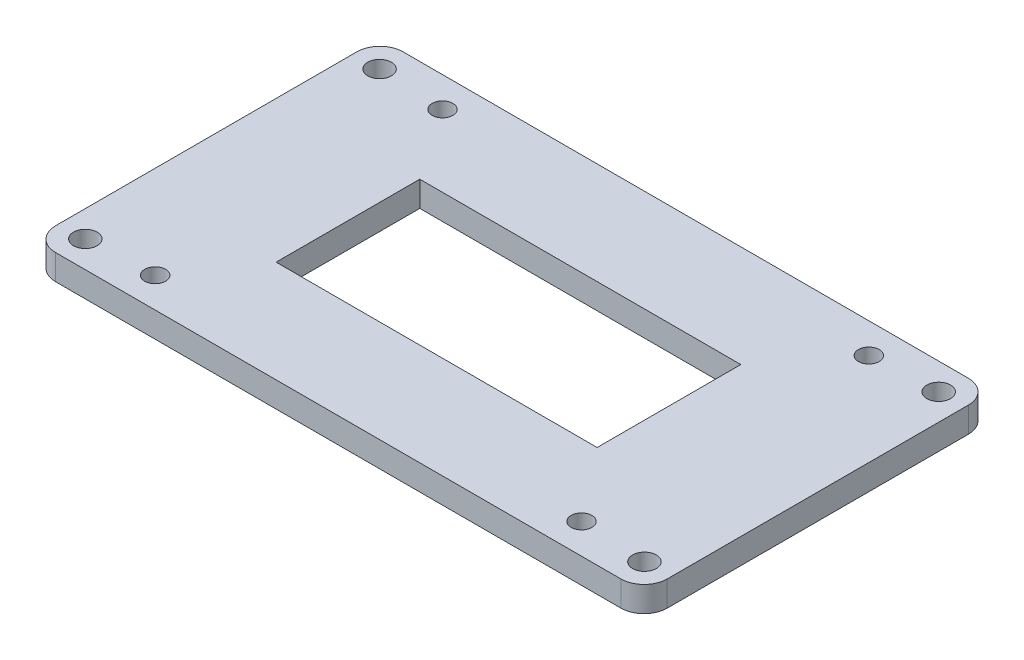
ISO-10303-21;
HEADER;
FILE_DESCRIPTION(('STEP AP214'),'2;1');
FILE_NAME('part.step','',(''),(''),'','','');
FILE_SCHEMA(('AUTOMOTIVE_DESIGN { 1 0 10303 214 1 1 1 1 }'));
ENDSEC;
DATA;
#1=APPLICATION_CONTEXT('core data for automotive mechanical design processes');
#2=APPLICATION_PROTOCOL_DEFINITION('international standard','automotive_design',2000,#1);
#3=PRODUCT_CONTEXT('',#1,'mechanical');
#4=PRODUCT('Part','Part','',(#3));
#5=PRODUCT_RELATED_PRODUCT_CATEGORY('part','',(#4));
#6=PRODUCT_DEFINITION_FORMATION('','',#4);
#7=PRODUCT_DEFINITION_CONTEXT('part definition',#1,'design');
#8=PRODUCT_DEFINITION('design','',#6,#7);
#9=PRODUCT_DEFINITION_SHAPE('','',#8);
#10=(LENGTH_UNIT() NAMED_UNIT(*) SI_UNIT(.MILLI.,.METRE.));
#11=(NAMED_UNIT(*) PLANE_ANGLE_UNIT() SI_UNIT($,.RADIAN.));
#12=(NAMED_UNIT(*) SI_UNIT($,.STERADIAN.) SOLID_ANGLE_UNIT());
#13=UNCERTAINTY_MEASURE_WITH_UNIT(LENGTH_MEASURE(1.E-05),#10,'distance_accuracy_value','');
#14=(GEOMETRIC_REPRESENTATION_CONTEXT(3) GLOBAL_UNCERTAINTY_ASSIGNED_CONTEXT((#13)) GLOBAL_UNIT_ASSIGNED_CONTEXT((#10,
#11,#12)) REPRESENTATION_CONTEXT('',''));
#15=CARTESIAN_POINT('',(0.,0.,0.));
#16=DIRECTION('',(0.,0.,1.));
#17=DIRECTION('',(1.,0.,0.));
#18=AXIS2_PLACEMENT_3D('',#15,#16,#17);
#19=CARTESIAN_POINT('',(66.,5.461,-37.5));
#20=DIRECTION('',(-1.,0.,0.));
#21=DIRECTION('',(0.,0.,1.));
#22=AXIS2_PLACEMENT_3D('',#19,#20,#21);
#23=PLANE('',#22);
#24=DIRECTION('',(0.,0.,-1.));
#25=VECTOR('',#24,1.);
#26=CARTESIAN_POINT('',(66.,5.461,-37.5));
#27=LINE('',#26,#25);
#28=CARTESIAN_POINT('',(66.,5.461,32.5));
#29=VERTEX_POINT('',#28);
#30=CARTESIAN_POINT('',(66.,5.461,-32.5));
#31=VERTEX_POINT('',#30);
#32=EDGE_CURVE('E206',#29,#31,#27,.T.);
#33=ORIENTED_EDGE('',*,*,#32,.F.);
#34=DIRECTION('',(0.,-1.,0.));
#35=VECTOR('',#34,1.);
#36=CARTESIAN_POINT('',(66.,5.461,32.5));
#37=LINE('',#36,#35);
#38=CARTESIAN_POINT('',(66.,0.,32.5));
#39=VERTEX_POINT('',#38);
#40=EDGE_CURVE('E231',#29,#39,#37,.T.);
#41=ORIENTED_EDGE('',*,*,#40,.T.);
#42=DIRECTION('',(0.,0.,-1.));
#43=VECTOR('',#42,1.);
#44=CARTESIAN_POINT('',(66.,0.,-37.5));
#45=LINE('',#44,#43);
#46=CARTESIAN_POINT('',(66.,0.,-32.5));
#47=VERTEX_POINT('',#46);
#48=EDGE_CURVE('E205',#39,#47,#45,.T.);
#49=ORIENTED_EDGE('',*,*,#48,.T.);
#50=DIRECTION('',(0.,-1.,0.));
#51=VECTOR('',#50,1.);
#52=CARTESIAN_POINT('',(66.,5.461,-32.5));
#53=LINE('',#52,#51);
#54=EDGE_CURVE('E219',#47,#31,#53,.F.);
#55=ORIENTED_EDGE('',*,*,#54,.T.);
#56=EDGE_LOOP('',(#33,#41,#49,#55));
#57=FACE_BOUND('',#56,.T.);
#58=ADVANCED_FACE('F33',(#57),#23,.F.);
#59=CARTESIAN_POINT('',(-66.,5.461,-37.5));
#60=DIRECTION('',(0.,0.,1.));
#61=DIRECTION('',(1.,0.,0.));
#62=AXIS2_PLACEMENT_3D('',#59,#60,#61);
#63=PLANE('',#62);
#64=DIRECTION('',(-1.,0.,0.));
#65=VECTOR('',#64,1.);
#66=CARTESIAN_POINT('',(-66.,5.461,-37.5));
#67=LINE('',#66,#65);
#68=CARTESIAN_POINT('',(61.,5.461,-37.5));
#69=VERTEX_POINT('',#68);
#70=CARTESIAN_POINT('',(-61.,5.461,-37.5));
#71=VERTEX_POINT('',#70);
#72=EDGE_CURVE('E209',#69,#71,#67,.T.);
#73=ORIENTED_EDGE('',*,*,#72,.F.);
#74=DIRECTION('',(0.,-1.,0.));
#75=VECTOR('',#74,1.);
#76=CARTESIAN_POINT('',(61.,5.461,-37.5));
#77=LINE('',#76,#75);
#78=CARTESIAN_POINT('',(61.,0.,-37.5));
#79=VERTEX_POINT('',#78);
#80=EDGE_CURVE('E257',#69,#79,#77,.T.);
#81=ORIENTED_EDGE('',*,*,#80,.T.);
#82=DIRECTION('',(-1.,0.,0.));
#83=VECTOR('',#82,1.);
#84=CARTESIAN_POINT('',(-66.,0.,-37.5));
#85=LINE('',#84,#83);
#86=CARTESIAN_POINT('',(-61.,0.,-37.5));
#87=VERTEX_POINT('',#86);
#88=EDGE_CURVE('E222',#79,#87,#85,.T.);
#89=ORIENTED_EDGE('',*,*,#88,.T.);
#90=DIRECTION('',(0.,-1.,0.));
#91=VECTOR('',#90,1.);
#92=CARTESIAN_POINT('',(-61.,5.461,-37.5));
#93=LINE('',#92,#91);
#94=EDGE_CURVE('E255',#87,#71,#93,.F.);
#95=ORIENTED_EDGE('',*,*,#94,.T.);
#96=EDGE_LOOP('',(#73,#81,#89,#95));
#97=FACE_BOUND('',#96,.T.);
#98=ADVANCED_FACE('F295',(#97),#63,.F.);
#99=CARTESIAN_POINT('',(-66.,5.461,-37.5));
#100=DIRECTION('',(1.,0.,0.));
#101=DIRECTION('',(0.,0.,-1.));
#102=AXIS2_PLACEMENT_3D('',#99,#100,#101);
#103=PLANE('',#102);
#104=DIRECTION('',(0.,0.,1.));
#105=VECTOR('',#104,1.);
#106=CARTESIAN_POINT('',(-66.,0.,-37.5));
#107=LINE('',#106,#105);
#108=CARTESIAN_POINT('',(-66.,0.,-32.5));
#109=VERTEX_POINT('',#108);
#110=CARTESIAN_POINT('',(-66.,0.,32.5));
#111=VERTEX_POINT('',#110);
#112=EDGE_CURVE('E225',#109,#111,#107,.T.);
#113=ORIENTED_EDGE('',*,*,#112,.T.);
#114=DIRECTION('',(0.,-1.,0.));
#115=VECTOR('',#114,1.);
#116=CARTESIAN_POINT('',(-66.,5.461,32.5));
#117=LINE('',#116,#115);
#118=CARTESIAN_POINT('',(-66.,5.461,32.5));
#119=VERTEX_POINT('',#118);
#120=EDGE_CURVE('E11',#111,#119,#117,.F.);
#121=ORIENTED_EDGE('',*,*,#120,.T.);
#122=DIRECTION('',(0.,0.,1.));
#123=VECTOR('',#122,1.);
#124=CARTESIAN_POINT('',(-66.,5.461,-37.5));
#125=LINE('',#124,#123);
#126=CARTESIAN_POINT('',(-66.,5.461,-32.5));
#127=VERTEX_POINT('',#126);
#128=EDGE_CURVE('E213',#127,#119,#125,.T.);
#129=ORIENTED_EDGE('',*,*,#128,.F.);
#130=DIRECTION('',(0.,-1.,0.));
#131=VECTOR('',#130,1.);
#132=CARTESIAN_POINT('',(-66.,5.461,-32.5));
#133=LINE('',#132,#131);
#134=EDGE_CURVE('E41',#127,#109,#133,.T.);
#135=ORIENTED_EDGE('',*,*,#134,.T.);
#136=EDGE_LOOP('',(#113,#121,#129,#135));
#137=FACE_BOUND('',#136,.T.);
#138=ADVANCED_FACE('F264',(#137),#103,.F.);
#139=CARTESIAN_POINT('',(-66.,5.461,37.5));
#140=DIRECTION('',(0.,0.,-1.));
#141=DIRECTION('',(-1.,0.,0.));
#142=AXIS2_PLACEMENT_3D('',#139,#140,#141);
#143=PLANE('',#142);
#144=DIRECTION('',(1.,0.,0.));
#145=VECTOR('',#144,1.);
#146=CARTESIAN_POINT('',(-66.,0.,37.5));
#147=LINE('',#146,#145);
#148=CARTESIAN_POINT('',(-61.,0.,37.5));
#149=VERTEX_POINT('',#148);
#150=CARTESIAN_POINT('',(61.,0.,37.5));
#151=VERTEX_POINT('',#150);
#152=EDGE_CURVE('E210',#149,#151,#147,.T.);
#153=ORIENTED_EDGE('',*,*,#152,.T.);
#154=DIRECTION('',(0.,-1.,0.));
#155=VECTOR('',#154,1.);
#156=CARTESIAN_POINT('',(61.,5.461,37.5));
#157=LINE('',#156,#155);
#158=CARTESIAN_POINT('',(61.,5.461,37.5));
#159=VERTEX_POINT('',#158);
#160=EDGE_CURVE('E245',#151,#159,#157,.F.);
#161=ORIENTED_EDGE('',*,*,#160,.T.);
#162=DIRECTION('',(1.,0.,0.));
#163=VECTOR('',#162,1.);
#164=CARTESIAN_POINT('',(-66.,5.461,37.5));
#165=LINE('',#164,#163);
#166=CARTESIAN_POINT('',(-61.,5.461,37.5));
#167=VERTEX_POINT('',#166);
#168=EDGE_CURVE('E216',#167,#159,#165,.T.);
#169=ORIENTED_EDGE('',*,*,#168,.F.);
#170=DIRECTION('',(0.,-1.,0.));
#171=VECTOR('',#170,1.);
#172=CARTESIAN_POINT('',(-61.,5.461,37.5));
#173=LINE('',#172,#171);
#174=EDGE_CURVE('E242',#167,#149,#173,.T.);
#175=ORIENTED_EDGE('',*,*,#174,.T.);
#176=EDGE_LOOP('',(#153,#161,#169,#175));
#177=FACE_BOUND('',#176,.T.);
#178=ADVANCED_FACE('F278',(#177),#143,.F.);
#179=CARTESIAN_POINT('',(0.,5.461,0.));
#180=DIRECTION('',(0.,1.,0.));
#181=DIRECTION('',(0.,0.,1.));
#182=AXIS2_PLACEMENT_3D('',#179,#180,#181);
#183=PLANE('',#182);
#184=DIRECTION('',(0.,0.,-1.));
#185=VECTOR('',#184,1.);
#186=CARTESIAN_POINT('',(33.87,5.461,-15.5));
#187=LINE('',#186,#185);
#188=CARTESIAN_POINT('',(33.87,5.461,15.5));
#189=VERTEX_POINT('',#188);
#190=CARTESIAN_POINT('',(33.87,5.461,-15.5));
#191=VERTEX_POINT('',#190);
#192=EDGE_CURVE('E48',#189,#191,#187,.T.);
#193=ORIENTED_EDGE('',*,*,#192,.F.);
#194=DIRECTION('',(1.,0.,0.));
#195=VECTOR('',#194,1.);
#196=CARTESIAN_POINT('',(-35.4,5.461,15.5));
#197=LINE('',#196,#195);
#198=CARTESIAN_POINT('',(-35.4,5.461,15.5));
#199=VERTEX_POINT('',#198);
#200=EDGE_CURVE('E139',#199,#189,#197,.T.);
#201=ORIENTED_EDGE('',*,*,#200,.F.);
#202=DIRECTION('',(0.,0.,1.));
#203=VECTOR('',#202,1.);
#204=CARTESIAN_POINT('',(-35.4,5.461,-15.5));
#205=LINE('',#204,#203);
#206=CARTESIAN_POINT('',(-35.4,5.461,-15.5));
#207=VERTEX_POINT('',#206);
#208=EDGE_CURVE('E142',#207,#199,#205,.T.);
#209=ORIENTED_EDGE('',*,*,#208,.F.);
#210=DIRECTION('',(-1.,0.,0.));
#211=VECTOR('',#210,1.);
#212=CARTESIAN_POINT('',(-35.4,5.461,-15.5));
#213=LINE('',#212,#211);
#214=EDGE_CURVE('E148',#191,#207,#213,.T.);
#215=ORIENTED_EDGE('',*,*,#214,.F.);
#216=EDGE_LOOP('',(#193,#201,#209,#215));
#217=FACE_BOUND('',#216,.T.);
#218=CARTESIAN_POINT('',(60.325,5.461,31.75));
#219=DIRECTION('',(0.,1.,0.));
#220=DIRECTION('',(0.,0.,1.));
#221=AXIS2_PLACEMENT_3D('',#218,#219,#220);
#222=CIRCLE('',#221,2.5527);
#223=CARTESIAN_POINT('',(60.325,5.461,34.3027));
#224=VERTEX_POINT('',#223);
#225=EDGE_CURVE('E154',#224,#224,#222,.T.);
#226=ORIENTED_EDGE('',*,*,#225,.F.);
#227=EDGE_LOOP('',(#226));
#228=FACE_BOUND('',#227,.T.);
#229=CARTESIAN_POINT('',(-60.325,5.461,-31.75));
#230=DIRECTION('',(0.,1.,0.));
#231=DIRECTION('',(0.,0.,1.));
#232=AXIS2_PLACEMENT_3D('',#229,#230,#231);
#233=CIRCLE('',#232,2.5527);
#234=CARTESIAN_POINT('',(-60.325,5.461,-29.1973));
#235=VERTEX_POINT('',#234);
#236=EDGE_CURVE('E163',#235,#235,#233,.T.);
#237=ORIENTED_EDGE('',*,*,#236,.F.);
#238=EDGE_LOOP('',(#237));
#239=FACE_BOUND('',#238,.T.);
#240=CARTESIAN_POINT('',(-60.325,5.461,31.75));
#241=DIRECTION('',(0.,1.,0.));
#242=DIRECTION('',(0.,0.,1.));
#243=AXIS2_PLACEMENT_3D('',#240,#241,#242);
#244=CIRCLE('',#243,2.5527);
#245=CARTESIAN_POINT('',(-60.325,5.461,34.3027));
#246=VERTEX_POINT('',#245);
#247=EDGE_CURVE('E169',#246,#246,#244,.T.);
#248=ORIENTED_EDGE('',*,*,#247,.F.);
#249=EDGE_LOOP('',(#248));
#250=FACE_BOUND('',#249,.T.);
#251=CARTESIAN_POINT('',(60.325,5.461,-31.75));
#252=DIRECTION('',(0.,1.,0.));
#253=DIRECTION('',(0.,0.,1.));
#254=AXIS2_PLACEMENT_3D('',#251,#252,#253);
#255=CIRCLE('',#254,2.5527);
#256=CARTESIAN_POINT('',(60.325,5.461,-29.1973));
#257=VERTEX_POINT('',#256);
#258=EDGE_CURVE('E175',#257,#257,#255,.T.);
#259=ORIENTED_EDGE('',*,*,#258,.F.);
#260=EDGE_LOOP('',(#259));
#261=FACE_BOUND('',#260,.T.);
#262=CARTESIAN_POINT('',(46.,5.461,31.));
#263=DIRECTION('',(0.,1.,0.));
#264=DIRECTION('',(0.,0.,1.));
#265=AXIS2_PLACEMENT_3D('',#262,#263,#264);
#266=CIRCLE('',#265,2.2479);
#267=CARTESIAN_POINT('',(46.,5.461,33.2479));
#268=VERTEX_POINT('',#267);
#269=EDGE_CURVE('E181',#268,#268,#266,.T.);
#270=ORIENTED_EDGE('',*,*,#269,.F.);
#271=EDGE_LOOP('',(#270));
#272=FACE_BOUND('',#271,.T.);
#273=CARTESIAN_POINT('',(-46.,5.461,-31.));
#274=DIRECTION('',(0.,1.,0.));
#275=DIRECTION('',(0.,0.,1.));
#276=AXIS2_PLACEMENT_3D('',#273,#274,#275);
#277=CIRCLE('',#276,2.2479);
#278=CARTESIAN_POINT('',(-46.,5.461,-28.7521));
#279=VERTEX_POINT('',#278);
#280=EDGE_CURVE('E187',#279,#279,#277,.T.);
#281=ORIENTED_EDGE('',*,*,#280,.F.);
#282=EDGE_LOOP('',(#281));
#283=FACE_BOUND('',#282,.T.);
#284=CARTESIAN_POINT('',(-46.,5.461,31.));
#285=DIRECTION('',(0.,1.,0.));
#286=DIRECTION('',(0.,0.,1.));
#287=AXIS2_PLACEMENT_3D('',#284,#285,#286);
#288=CIRCLE('',#287,2.2479);
#289=CARTESIAN_POINT('',(-46.,5.461,33.2479));
#290=VERTEX_POINT('',#289);
#291=EDGE_CURVE('E193',#290,#290,#288,.T.);
#292=ORIENTED_EDGE('',*,*,#291,.F.);
#293=EDGE_LOOP('',(#292));
#294=FACE_BOUND('',#293,.T.);
#295=CARTESIAN_POINT('',(46.,5.461,-31.));
#296=DIRECTION('',(0.,1.,0.));
#297=DIRECTION('',(0.,0.,1.));
#298=AXIS2_PLACEMENT_3D('',#295,#296,#297);
#299=CIRCLE('',#298,2.2479);
#300=CARTESIAN_POINT('',(46.,5.461,-28.7521));
#301=VERTEX_POINT('',#300);
#302=EDGE_CURVE('E199',#301,#301,#299,.T.);
#303=ORIENTED_EDGE('',*,*,#302,.F.);
#304=EDGE_LOOP('',(#303));
#305=FACE_BOUND('',#304,.T.);
#306=ORIENTED_EDGE('',*,*,#168,.T.);
#307=CARTESIAN_POINT('',(61.,5.461,32.5));
#308=DIRECTION('',(0.,1.,0.));
#309=DIRECTION('',(0.,0.,1.));
#310=AXIS2_PLACEMENT_3D('',#307,#308,#309);
#311=CIRCLE('',#310,5.);
#312=EDGE_CURVE('E253',#159,#29,#311,.T.);
#313=ORIENTED_EDGE('',*,*,#312,.T.);
#314=ORIENTED_EDGE('',*,*,#32,.T.);
#315=CARTESIAN_POINT('',(61.,5.461,-32.5));
#316=DIRECTION('',(0.,1.,0.));
#317=DIRECTION('',(0.,0.,1.));
#318=AXIS2_PLACEMENT_3D('',#315,#316,#317);
#319=CIRCLE('',#318,5.);
#320=EDGE_CURVE('E251',#31,#69,#319,.T.);
#321=ORIENTED_EDGE('',*,*,#320,.T.);
#322=ORIENTED_EDGE('',*,*,#72,.T.);
#323=CARTESIAN_POINT('',(-61.,5.461,-32.5));
#324=DIRECTION('',(0.,1.,0.));
#325=DIRECTION('',(0.,0.,1.));
#326=AXIS2_PLACEMENT_3D('',#323,#324,#325);
#327=CIRCLE('',#326,5.);
#328=EDGE_CURVE('E247',#71,#127,#327,.T.);
#329=ORIENTED_EDGE('',*,*,#328,.T.);
#330=ORIENTED_EDGE('',*,*,#128,.T.);
#331=CARTESIAN_POINT('',(-61.,5.461,32.5));
#332=DIRECTION('',(0.,1.,0.));
#333=DIRECTION('',(0.,0.,1.));
#334=AXIS2_PLACEMENT_3D('',#331,#332,#333);
#335=CIRCLE('',#334,5.);
#336=EDGE_CURVE('E249',#119,#167,#335,.T.);
#337=ORIENTED_EDGE('',*,*,#336,.T.);
#338=EDGE_LOOP('',(#306,#313,#314,#321,#322,#329,#330,#337));
#339=FACE_BOUND('',#338,.T.);
#340=ADVANCED_FACE('F282',(#217,#228,#239,#250,#261,#272,#283,#294,#305,#339),#183,.T.);
#341=CARTESIAN_POINT('',(0.,0.,0.));
#342=DIRECTION('',(0.,1.,0.));
#343=DIRECTION('',(0.,0.,1.));
#344=AXIS2_PLACEMENT_3D('',#341,#342,#343);
#345=PLANE('',#344);
#346=DIRECTION('',(1.,0.,0.));
#347=VECTOR('',#346,1.);
#348=CARTESIAN_POINT('',(-35.4,0.,15.5));
#349=LINE('',#348,#347);
#350=CARTESIAN_POINT('',(-35.4,0.,15.5));
#351=VERTEX_POINT('',#350);
#352=CARTESIAN_POINT('',(33.87,0.,15.5));
#353=VERTEX_POINT('',#352);
#354=EDGE_CURVE('E129',#351,#353,#349,.T.);
#355=ORIENTED_EDGE('',*,*,#354,.T.);
#356=DIRECTION('',(0.,0.,-1.));
#357=VECTOR('',#356,1.);
#358=CARTESIAN_POINT('',(33.87,0.,-15.5));
#359=LINE('',#358,#357);
#360=CARTESIAN_POINT('',(33.87,0.,-15.5));
#361=VERTEX_POINT('',#360);
#362=EDGE_CURVE('E123',#353,#361,#359,.T.);
#363=ORIENTED_EDGE('',*,*,#362,.T.);
#364=DIRECTION('',(-1.,0.,0.));
#365=VECTOR('',#364,1.);
#366=CARTESIAN_POINT('',(-35.4,0.,-15.5));
#367=LINE('',#366,#365);
#368=CARTESIAN_POINT('',(-35.4,0.,-15.5));
#369=VERTEX_POINT('',#368);
#370=EDGE_CURVE('E132',#361,#369,#367,.T.);
#371=ORIENTED_EDGE('',*,*,#370,.T.);
#372=DIRECTION('',(0.,0.,1.));
#373=VECTOR('',#372,1.);
#374=CARTESIAN_POINT('',(-35.4,0.,-15.5));
#375=LINE('',#374,#373);
#376=EDGE_CURVE('E56',#369,#351,#375,.T.);
#377=ORIENTED_EDGE('',*,*,#376,.T.);
#378=EDGE_LOOP('',(#355,#363,#371,#377));
#379=FACE_BOUND('',#378,.T.);
#380=CARTESIAN_POINT('',(60.325,0.,31.75));
#381=DIRECTION('',(0.,1.,0.));
#382=DIRECTION('',(0.,0.,1.));
#383=AXIS2_PLACEMENT_3D('',#380,#381,#382);
#384=CIRCLE('',#383,2.5527);
#385=CARTESIAN_POINT('',(60.325,0.,34.3027));
#386=VERTEX_POINT('',#385);
#387=EDGE_CURVE('E160',#386,#386,#384,.T.);
#388=ORIENTED_EDGE('',*,*,#387,.T.);
#389=EDGE_LOOP('',(#388));
#390=FACE_BOUND('',#389,.T.);
#391=CARTESIAN_POINT('',(-60.325,0.,-31.75));
#392=DIRECTION('',(0.,1.,0.));
#393=DIRECTION('',(0.,0.,1.));
#394=AXIS2_PLACEMENT_3D('',#391,#392,#393);
#395=CIRCLE('',#394,2.5527);
#396=CARTESIAN_POINT('',(-60.325,0.,-29.1973));
#397=VERTEX_POINT('',#396);
#398=EDGE_CURVE('E166',#397,#397,#395,.T.);
#399=ORIENTED_EDGE('',*,*,#398,.T.);
#400=EDGE_LOOP('',(#399));
#401=FACE_BOUND('',#400,.T.);
#402=CARTESIAN_POINT('',(-60.325,0.,31.75));
#403=DIRECTION('',(0.,1.,0.));
#404=DIRECTION('',(0.,0.,1.));
#405=AXIS2_PLACEMENT_3D('',#402,#403,#404);
#406=CIRCLE('',#405,2.5527);
#407=CARTESIAN_POINT('',(-60.325,0.,34.3027));
#408=VERTEX_POINT('',#407);
#409=EDGE_CURVE('E172',#408,#408,#406,.T.);
#410=ORIENTED_EDGE('',*,*,#409,.T.);
#411=EDGE_LOOP('',(#410));
#412=FACE_BOUND('',#411,.T.);
#413=CARTESIAN_POINT('',(60.325,0.,-31.75));
#414=DIRECTION('',(0.,1.,0.));
#415=DIRECTION('',(0.,0.,1.));
#416=AXIS2_PLACEMENT_3D('',#413,#414,#415);
#417=CIRCLE('',#416,2.5527);
#418=CARTESIAN_POINT('',(60.325,0.,-29.1973));
#419=VERTEX_POINT('',#418);
#420=EDGE_CURVE('E178',#419,#419,#417,.T.);
#421=ORIENTED_EDGE('',*,*,#420,.T.);
#422=EDGE_LOOP('',(#421));
#423=FACE_BOUND('',#422,.T.);
#424=CARTESIAN_POINT('',(46.,0.,31.));
#425=DIRECTION('',(0.,1.,0.));
#426=DIRECTION('',(0.,0.,1.));
#427=AXIS2_PLACEMENT_3D('',#424,#425,#426);
#428=CIRCLE('',#427,2.2479);
#429=CARTESIAN_POINT('',(46.,0.,33.2479));
#430=VERTEX_POINT('',#429);
#431=EDGE_CURVE('E184',#430,#430,#428,.T.);
#432=ORIENTED_EDGE('',*,*,#431,.T.);
#433=EDGE_LOOP('',(#432));
#434=FACE_BOUND('',#433,.T.);
#435=CARTESIAN_POINT('',(-46.,0.,-31.));
#436=DIRECTION('',(0.,1.,0.));
#437=DIRECTION('',(0.,0.,1.));
#438=AXIS2_PLACEMENT_3D('',#435,#436,#437);
#439=CIRCLE('',#438,2.2479);
#440=CARTESIAN_POINT('',(-46.,0.,-28.7521));
#441=VERTEX_POINT('',#440);
#442=EDGE_CURVE('E190',#441,#441,#439,.T.);
#443=ORIENTED_EDGE('',*,*,#442,.T.);
#444=EDGE_LOOP('',(#443));
#445=FACE_BOUND('',#444,.T.);
#446=CARTESIAN_POINT('',(-46.,0.,31.));
#447=DIRECTION('',(0.,1.,0.));
#448=DIRECTION('',(0.,0.,1.));
#449=AXIS2_PLACEMENT_3D('',#446,#447,#448);
#450=CIRCLE('',#449,2.2479);
#451=CARTESIAN_POINT('',(-46.,0.,33.2479));
#452=VERTEX_POINT('',#451);
#453=EDGE_CURVE('E196',#452,#452,#450,.T.);
#454=ORIENTED_EDGE('',*,*,#453,.T.);
#455=EDGE_LOOP('',(#454));
#456=FACE_BOUND('',#455,.T.);
#457=CARTESIAN_POINT('',(46.,0.,-31.));
#458=DIRECTION('',(0.,1.,0.));
#459=DIRECTION('',(0.,0.,1.));
#460=AXIS2_PLACEMENT_3D('',#457,#458,#459);
#461=CIRCLE('',#460,2.2479);
#462=CARTESIAN_POINT('',(46.,0.,-28.7521));
#463=VERTEX_POINT('',#462);
#464=EDGE_CURVE('E202',#463,#463,#461,.T.);
#465=ORIENTED_EDGE('',*,*,#464,.T.);
#466=EDGE_LOOP('',(#465));
#467=FACE_BOUND('',#466,.T.);
#468=ORIENTED_EDGE('',*,*,#48,.F.);
#469=CARTESIAN_POINT('',(61.,0.,32.5));
#470=DIRECTION('',(0.,1.,0.));
#471=DIRECTION('',(0.,0.,1.));
#472=AXIS2_PLACEMENT_3D('',#469,#470,#471);
#473=CIRCLE('',#472,5.);
#474=EDGE_CURVE('E240',#39,#151,#473,.F.);
#475=ORIENTED_EDGE('',*,*,#474,.T.);
#476=ORIENTED_EDGE('',*,*,#152,.F.);
#477=CARTESIAN_POINT('',(-61.,0.,32.5));
#478=DIRECTION('',(0.,1.,0.));
#479=DIRECTION('',(0.,0.,1.));
#480=AXIS2_PLACEMENT_3D('',#477,#478,#479);
#481=CIRCLE('',#480,5.);
#482=EDGE_CURVE('E236',#149,#111,#481,.F.);
#483=ORIENTED_EDGE('',*,*,#482,.T.);
#484=ORIENTED_EDGE('',*,*,#112,.F.);
#485=CARTESIAN_POINT('',(-61.,0.,-32.5));
#486=DIRECTION('',(0.,1.,0.));
#487=DIRECTION('',(0.,0.,1.));
#488=AXIS2_PLACEMENT_3D('',#485,#486,#487);
#489=CIRCLE('',#488,5.);
#490=EDGE_CURVE('E234',#109,#87,#489,.F.);
#491=ORIENTED_EDGE('',*,*,#490,.T.);
#492=ORIENTED_EDGE('',*,*,#88,.F.);
#493=CARTESIAN_POINT('',(61.,0.,-32.5));
#494=DIRECTION('',(0.,1.,0.));
#495=DIRECTION('',(0.,0.,1.));
#496=AXIS2_PLACEMENT_3D('',#493,#494,#495);
#497=CIRCLE('',#496,5.);
#498=EDGE_CURVE('E238',#79,#47,#497,.F.);
#499=ORIENTED_EDGE('',*,*,#498,.T.);
#500=EDGE_LOOP('',(#468,#475,#476,#483,#484,#491,#492,#499));
#501=FACE_BOUND('',#500,.T.);
#502=ADVANCED_FACE('F136',(#379,#390,#401,#412,#423,#434,#445,#456,#467,#501),#345,.F.);
#503=CARTESIAN_POINT('',(46.,5.461,-31.));
#504=DIRECTION('',(0.,1.,0.));
#505=DIRECTION('',(0.,0.,1.));
#506=AXIS2_PLACEMENT_3D('',#503,#504,#505);
#507=CYLINDRICAL_SURFACE('',#506,2.2479);
#508=ORIENTED_EDGE('',*,*,#464,.F.);
#509=EDGE_LOOP('',(#508));
#510=FACE_BOUND('',#509,.T.);
#511=ORIENTED_EDGE('',*,*,#302,.T.);
#512=EDGE_LOOP('',(#511));
#513=FACE_BOUND('',#512,.T.);
#514=ADVANCED_FACE('F346',(#510,#513),#507,.F.);
#515=CARTESIAN_POINT('',(-46.,5.461,31.));
#516=DIRECTION('',(0.,1.,0.));
#517=DIRECTION('',(0.,0.,1.));
#518=AXIS2_PLACEMENT_3D('',#515,#516,#517);
#519=CYLINDRICAL_SURFACE('',#518,2.2479);
#520=ORIENTED_EDGE('',*,*,#453,.F.);
#521=EDGE_LOOP('',(#520));
#522=FACE_BOUND('',#521,.T.);
#523=ORIENTED_EDGE('',*,*,#291,.T.);
#524=EDGE_LOOP('',(#523));
#525=FACE_BOUND('',#524,.T.);
#526=ADVANCED_FACE('F403',(#522,#525),#519,.F.);
#527=CARTESIAN_POINT('',(-46.,5.461,-31.));
#528=DIRECTION('',(0.,1.,0.));
#529=DIRECTION('',(0.,0.,1.));
#530=AXIS2_PLACEMENT_3D('',#527,#528,#529);
#531=CYLINDRICAL_SURFACE('',#530,2.2479);
#532=ORIENTED_EDGE('',*,*,#442,.F.);
#533=EDGE_LOOP('',(#532));
#534=FACE_BOUND('',#533,.T.);
#535=ORIENTED_EDGE('',*,*,#280,.T.);
#536=EDGE_LOOP('',(#535));
#537=FACE_BOUND('',#536,.T.);
#538=ADVANCED_FACE('F399',(#534,#537),#531,.F.);
#539=CARTESIAN_POINT('',(46.,5.461,31.));
#540=DIRECTION('',(0.,1.,0.));
#541=DIRECTION('',(0.,0.,1.));
#542=AXIS2_PLACEMENT_3D('',#539,#540,#541);
#543=CYLINDRICAL_SURFACE('',#542,2.2479);
#544=ORIENTED_EDGE('',*,*,#431,.F.);
#545=EDGE_LOOP('',(#544));
#546=FACE_BOUND('',#545,.T.);
#547=ORIENTED_EDGE('',*,*,#269,.T.);
#548=EDGE_LOOP('',(#547));
#549=FACE_BOUND('',#548,.T.);
#550=ADVANCED_FACE('F395',(#546,#549),#543,.F.);
#551=CARTESIAN_POINT('',(60.325,5.461,-31.75));
#552=DIRECTION('',(0.,1.,0.));
#553=DIRECTION('',(0.,0.,1.));
#554=AXIS2_PLACEMENT_3D('',#551,#552,#553);
#555=CYLINDRICAL_SURFACE('',#554,2.5527);
#556=ORIENTED_EDGE('',*,*,#420,.F.);
#557=EDGE_LOOP('',(#556));
#558=FACE_BOUND('',#557,.T.);
#559=ORIENTED_EDGE('',*,*,#258,.T.);
#560=EDGE_LOOP('',(#559));
#561=FACE_BOUND('',#560,.T.);
#562=ADVANCED_FACE('F391',(#558,#561),#555,.F.);
#563=CARTESIAN_POINT('',(-60.325,5.461,31.75));
#564=DIRECTION('',(0.,1.,0.));
#565=DIRECTION('',(0.,0.,1.));
#566=AXIS2_PLACEMENT_3D('',#563,#564,#565);
#567=CYLINDRICAL_SURFACE('',#566,2.5527);
#568=ORIENTED_EDGE('',*,*,#409,.F.);
#569=EDGE_LOOP('',(#568));
#570=FACE_BOUND('',#569,.T.);
#571=ORIENTED_EDGE('',*,*,#247,.T.);
#572=EDGE_LOOP('',(#571));
#573=FACE_BOUND('',#572,.T.);
#574=ADVANCED_FACE('F387',(#570,#573),#567,.F.);
#575=CARTESIAN_POINT('',(-60.325,5.461,-31.75));
#576=DIRECTION('',(0.,1.,0.));
#577=DIRECTION('',(0.,0.,1.));
#578=AXIS2_PLACEMENT_3D('',#575,#576,#577);
#579=CYLINDRICAL_SURFACE('',#578,2.5527);
#580=ORIENTED_EDGE('',*,*,#398,.F.);
#581=EDGE_LOOP('',(#580));
#582=FACE_BOUND('',#581,.T.);
#583=ORIENTED_EDGE('',*,*,#236,.T.);
#584=EDGE_LOOP('',(#583));
#585=FACE_BOUND('',#584,.T.);
#586=ADVANCED_FACE('F383',(#582,#585),#579,.F.);
#587=CARTESIAN_POINT('',(60.325,5.461,31.75));
#588=DIRECTION('',(0.,1.,0.));
#589=DIRECTION('',(0.,0.,1.));
#590=AXIS2_PLACEMENT_3D('',#587,#588,#589);
#591=CYLINDRICAL_SURFACE('',#590,2.5527);
#592=ORIENTED_EDGE('',*,*,#387,.F.);
#593=EDGE_LOOP('',(#592));
#594=FACE_BOUND('',#593,.T.);
#595=ORIENTED_EDGE('',*,*,#225,.T.);
#596=EDGE_LOOP('',(#595));
#597=FACE_BOUND('',#596,.T.);
#598=ADVANCED_FACE('F314',(#594,#597),#591,.F.);
#599=CARTESIAN_POINT('',(61.,5.461,32.5));
#600=DIRECTION('',(0.,-1.,0.));
#601=DIRECTION('',(0.,0.,-1.));
#602=AXIS2_PLACEMENT_3D('',#599,#600,#601);
#603=CYLINDRICAL_SURFACE('',#602,5.);
#604=ORIENTED_EDGE('',*,*,#312,.F.);
#605=ORIENTED_EDGE('',*,*,#160,.F.);
#606=ORIENTED_EDGE('',*,*,#474,.F.);
#607=ORIENTED_EDGE('',*,*,#40,.F.);
#608=EDGE_LOOP('',(#604,#605,#606,#607));
#609=FACE_BOUND('',#608,.T.);
#610=ADVANCED_FACE('F286',(#609),#603,.T.);
#611=CARTESIAN_POINT('',(61.,5.461,-32.5));
#612=DIRECTION('',(0.,-1.,0.));
#613=DIRECTION('',(0.,0.,-1.));
#614=AXIS2_PLACEMENT_3D('',#611,#612,#613);
#615=CYLINDRICAL_SURFACE('',#614,5.);
#616=ORIENTED_EDGE('',*,*,#320,.F.);
#617=ORIENTED_EDGE('',*,*,#54,.F.);
#618=ORIENTED_EDGE('',*,*,#498,.F.);
#619=ORIENTED_EDGE('',*,*,#80,.F.);
#620=EDGE_LOOP('',(#616,#617,#618,#619));
#621=FACE_BOUND('',#620,.T.);
#622=ADVANCED_FACE('F292',(#621),#615,.T.);
#623=CARTESIAN_POINT('',(-61.,5.461,32.5));
#624=DIRECTION('',(0.,-1.,0.));
#625=DIRECTION('',(0.,0.,-1.));
#626=AXIS2_PLACEMENT_3D('',#623,#624,#625);
#627=CYLINDRICAL_SURFACE('',#626,5.);
#628=ORIENTED_EDGE('',*,*,#336,.F.);
#629=ORIENTED_EDGE('',*,*,#120,.F.);
#630=ORIENTED_EDGE('',*,*,#482,.F.);
#631=ORIENTED_EDGE('',*,*,#174,.F.);
#632=EDGE_LOOP('',(#628,#629,#630,#631));
#633=FACE_BOUND('',#632,.T.);
#634=ADVANCED_FACE('F275',(#633),#627,.T.);
#635=CARTESIAN_POINT('',(-61.,5.461,-32.5));
#636=DIRECTION('',(0.,-1.,0.));
#637=DIRECTION('',(0.,0.,-1.));
#638=AXIS2_PLACEMENT_3D('',#635,#636,#637);
#639=CYLINDRICAL_SURFACE('',#638,5.);
#640=ORIENTED_EDGE('',*,*,#328,.F.);
#641=ORIENTED_EDGE('',*,*,#94,.F.);
#642=ORIENTED_EDGE('',*,*,#490,.F.);
#643=ORIENTED_EDGE('',*,*,#134,.F.);
#644=EDGE_LOOP('',(#640,#641,#642,#643));
#645=FACE_BOUND('',#644,.T.);
#646=ADVANCED_FACE('F35',(#645),#639,.T.);
#647=CARTESIAN_POINT('',(33.87,0.,-15.5));
#648=DIRECTION('',(1.,0.,0.));
#649=DIRECTION('',(0.,0.,-1.));
#650=AXIS2_PLACEMENT_3D('',#647,#648,#649);
#651=PLANE('',#650);
#652=ORIENTED_EDGE('',*,*,#192,.T.);
#653=DIRECTION('',(0.,1.,0.));
#654=VECTOR('',#653,1.);
#655=CARTESIAN_POINT('',(33.87,0.,-15.5));
#656=LINE('',#655,#654);
#657=EDGE_CURVE('E119',#361,#191,#656,.T.);
#658=ORIENTED_EDGE('',*,*,#657,.F.);
#659=ORIENTED_EDGE('',*,*,#362,.F.);
#660=DIRECTION('',(0.,1.,0.));
#661=VECTOR('',#660,1.);
#662=CARTESIAN_POINT('',(33.87,0.,15.5));
#663=LINE('',#662,#661);
#664=EDGE_CURVE('E152',#353,#189,#663,.T.);
#665=ORIENTED_EDGE('',*,*,#664,.T.);
#666=EDGE_LOOP('',(#652,#658,#659,#665));
#667=FACE_BOUND('',#666,.T.);
#668=ADVANCED_FACE('F121',(#667),#651,.F.);
#669=CARTESIAN_POINT('',(-35.4,0.,15.5));
#670=DIRECTION('',(0.,0.,1.));
#671=DIRECTION('',(1.,0.,0.));
#672=AXIS2_PLACEMENT_3D('',#669,#670,#671);
#673=PLANE('',#672);
#674=ORIENTED_EDGE('',*,*,#200,.T.);
#675=ORIENTED_EDGE('',*,*,#664,.F.);
#676=ORIENTED_EDGE('',*,*,#354,.F.);
#677=DIRECTION('',(0.,1.,0.));
#678=VECTOR('',#677,1.);
#679=CARTESIAN_POINT('',(-35.4,0.,15.5));
#680=LINE('',#679,#678);
#681=EDGE_CURVE('E155',#351,#199,#680,.T.);
#682=ORIENTED_EDGE('',*,*,#681,.T.);
#683=EDGE_LOOP('',(#674,#675,#676,#682));
#684=FACE_BOUND('',#683,.T.);
#685=ADVANCED_FACE('F302',(#684),#673,.F.);
#686=CARTESIAN_POINT('',(-35.4,0.,-15.5));
#687=DIRECTION('',(-1.,0.,0.));
#688=DIRECTION('',(0.,0.,1.));
#689=AXIS2_PLACEMENT_3D('',#686,#687,#688);
#690=PLANE('',#689);
#691=ORIENTED_EDGE('',*,*,#208,.T.);
#692=ORIENTED_EDGE('',*,*,#681,.F.);
#693=ORIENTED_EDGE('',*,*,#376,.F.);
#694=DIRECTION('',(0.,1.,0.));
#695=VECTOR('',#694,1.);
#696=CARTESIAN_POINT('',(-35.4,0.,-15.5));
#697=LINE('',#696,#695);
#698=EDGE_CURVE('E128',#369,#207,#697,.T.);
#699=ORIENTED_EDGE('',*,*,#698,.T.);
#700=EDGE_LOOP('',(#691,#692,#693,#699));
#701=FACE_BOUND('',#700,.T.);
#702=ADVANCED_FACE('F360',(#701),#690,.F.);
#703=CARTESIAN_POINT('',(-35.4,0.,-15.5));
#704=DIRECTION('',(0.,0.,-1.));
#705=DIRECTION('',(-1.,0.,0.));
#706=AXIS2_PLACEMENT_3D('',#703,#704,#705);
#707=PLANE('',#706);
#708=ORIENTED_EDGE('',*,*,#214,.T.);
#709=ORIENTED_EDGE('',*,*,#698,.F.);
#710=ORIENTED_EDGE('',*,*,#370,.F.);
#711=ORIENTED_EDGE('',*,*,#657,.T.);
#712=EDGE_LOOP('',(#708,#709,#710,#711));
#713=FACE_BOUND('',#712,.T.);
#714=ADVANCED_FACE('F133',(#713),#707,.F.);
#715=CLOSED_SHELL('',(#58,#98,#138,#178,#340,#502,#514,#526,#538,#550,#562,#574,#586,#598,#610,
#622,#634,#646,#668,#685,#702,#714));
#716=MANIFOLD_SOLID_BREP('B2',#715);
#717=ADVANCED_BREP_SHAPE_REPRESENTATION('',(#18,#716),#14);
#718=SHAPE_DEFINITION_REPRESENTATION(#9,#717);
ENDSEC;
END-ISO-10303-21;
